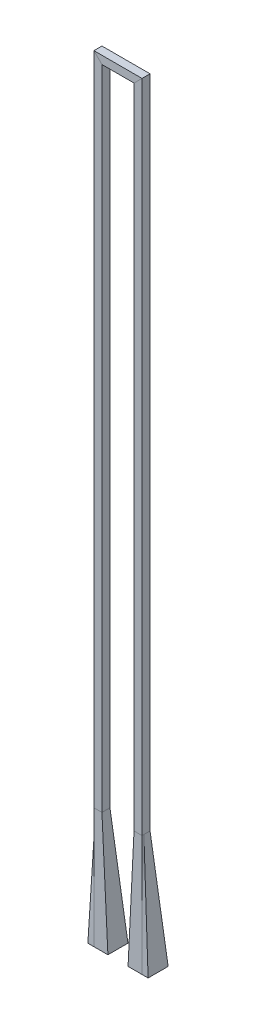
ISO-10303-21;
HEADER;
FILE_DESCRIPTION(('STEP AP214'),'2;1');
FILE_NAME('part.step','',(''),(''),'','','');
FILE_SCHEMA(('AUTOMOTIVE_DESIGN { 1 0 10303 214 1 1 1 1 }'));
ENDSEC;
DATA;
#1=APPLICATION_CONTEXT('core data for automotive mechanical design processes');
#2=APPLICATION_PROTOCOL_DEFINITION('international standard','automotive_design',2000,#1);
#3=PRODUCT_CONTEXT('',#1,'mechanical');
#4=PRODUCT('Part','Part','',(#3));
#5=PRODUCT_RELATED_PRODUCT_CATEGORY('part','',(#4));
#6=PRODUCT_DEFINITION_FORMATION('','',#4);
#7=PRODUCT_DEFINITION_CONTEXT('part definition',#1,'design');
#8=PRODUCT_DEFINITION('design','',#6,#7);
#9=PRODUCT_DEFINITION_SHAPE('','',#8);
#10=(LENGTH_UNIT() NAMED_UNIT(*) SI_UNIT(.MILLI.,.METRE.));
#11=(NAMED_UNIT(*) PLANE_ANGLE_UNIT() SI_UNIT($,.RADIAN.));
#12=(NAMED_UNIT(*) SI_UNIT($,.STERADIAN.) SOLID_ANGLE_UNIT());
#13=UNCERTAINTY_MEASURE_WITH_UNIT(LENGTH_MEASURE(1.E-05),#10,'distance_accuracy_value','');
#14=(GEOMETRIC_REPRESENTATION_CONTEXT(3) GLOBAL_UNCERTAINTY_ASSIGNED_CONTEXT((#13)) GLOBAL_UNIT_ASSIGNED_CONTEXT((#10,
#11,#12)) REPRESENTATION_CONTEXT('',''));
#15=CARTESIAN_POINT('',(0.,0.,0.));
#16=DIRECTION('',(0.,0.,1.));
#17=DIRECTION('',(1.,0.,0.));
#18=AXIS2_PLACEMENT_3D('',#15,#16,#17);
#19=CARTESIAN_POINT('',(2.794,41.6544,0.254));
#20=DIRECTION('',(-1.,0.,0.));
#21=DIRECTION('',(0.,-1.,0.));
#22=AXIS2_PLACEMENT_3D('',#19,#20,#21);
#23=PLANE('',#22);
#24=DIRECTION('',(0.,0.,1.));
#25=VECTOR('',#24,1.);
#26=CARTESIAN_POINT('',(2.79399999999999,41.529,0.254));
#27=LINE('',#26,#25);
#28=CARTESIAN_POINT('',(2.79399999999999,41.529,-0.254));
#29=VERTEX_POINT('',#28);
#30=CARTESIAN_POINT('',(2.79399999999999,41.529,0.254));
#31=VERTEX_POINT('',#30);
#32=EDGE_CURVE('E280',#29,#31,#27,.T.);
#33=ORIENTED_EDGE('',*,*,#32,.T.);
#34=DIRECTION('',(0.,-1.,0.));
#35=VECTOR('',#34,1.);
#36=CARTESIAN_POINT('',(2.794,41.6544,0.254));
#37=LINE('',#36,#35);
#38=CARTESIAN_POINT('',(2.794,0.,0.254));
#39=VERTEX_POINT('',#38);
#40=EDGE_CURVE('E851',#31,#39,#37,.T.);
#41=ORIENTED_EDGE('',*,*,#40,.T.);
#42=DIRECTION('',(0.,0.,-1.));
#43=VECTOR('',#42,1.);
#44=CARTESIAN_POINT('',(2.794,0.,0.254));
#45=LINE('',#44,#43);
#46=CARTESIAN_POINT('',(2.794,0.,0.136048087951876));
#47=VERTEX_POINT('',#46);
#48=EDGE_CURVE('E842',#39,#47,#45,.T.);
#49=ORIENTED_EDGE('',*,*,#48,.T.);
#50=DIRECTION('',(0.,0.,1.));
#51=VECTOR('',#50,1.);
#52=CARTESIAN_POINT('',(2.794,0.,-0.254));
#53=LINE('',#52,#51);
#54=CARTESIAN_POINT('',(2.794,0.,-0.254));
#55=VERTEX_POINT('',#54);
#56=EDGE_CURVE('E564',#55,#47,#53,.T.);
#57=ORIENTED_EDGE('',*,*,#56,.F.);
#58=DIRECTION('',(0.,-1.,0.));
#59=VECTOR('',#58,1.);
#60=CARTESIAN_POINT('',(2.794,41.6544,-0.254));
#61=LINE('',#60,#59);
#62=EDGE_CURVE('E840',#29,#55,#61,.T.);
#63=ORIENTED_EDGE('',*,*,#62,.F.);
#64=EDGE_LOOP('',(#33,#41,#49,#57,#63));
#65=FACE_BOUND('',#64,.T.);
#66=ADVANCED_FACE('F175',(#65),#23,.F.);
#67=CARTESIAN_POINT('',(2.794,41.6544,-0.254));
#68=DIRECTION('',(0.,0.,1.));
#69=DIRECTION('',(1.,0.,0.));
#70=AXIS2_PLACEMENT_3D('',#67,#68,#69);
#71=PLANE('',#70);
#72=DIRECTION('',(0.707106781186547,0.707106781186548,0.));
#73=VECTOR('',#72,1.);
#74=CARTESIAN_POINT('',(1.2073,39.9423,-0.254));
#75=LINE('',#74,#73);
#76=CARTESIAN_POINT('',(2.286,41.021,-0.254));
#77=VERTEX_POINT('',#76);
#78=EDGE_CURVE('E391',#77,#29,#75,.T.);
#79=ORIENTED_EDGE('',*,*,#78,.T.);
#80=ORIENTED_EDGE('',*,*,#62,.T.);
#81=DIRECTION('',(-1.,0.,0.));
#82=VECTOR('',#81,1.);
#83=CARTESIAN_POINT('',(2.794,0.,-0.254));
#84=LINE('',#83,#82);
#85=CARTESIAN_POINT('',(2.286,0.,-0.254));
#86=VERTEX_POINT('',#85);
#87=EDGE_CURVE('E829',#55,#86,#84,.T.);
#88=ORIENTED_EDGE('',*,*,#87,.T.);
#89=DIRECTION('',(0.,-1.,0.));
#90=VECTOR('',#89,1.);
#91=CARTESIAN_POINT('',(2.286,41.6544,-0.254));
#92=LINE('',#91,#90);
#93=EDGE_CURVE('E838',#77,#86,#92,.T.);
#94=ORIENTED_EDGE('',*,*,#93,.F.);
#95=EDGE_LOOP('',(#79,#80,#88,#94));
#96=FACE_BOUND('',#95,.T.);
#97=ADVANCED_FACE('F339',(#96),#71,.F.);
#98=CARTESIAN_POINT('',(2.286,41.6544,0.254));
#99=DIRECTION('',(1.,0.,0.));
#100=DIRECTION('',(0.,1.,0.));
#101=AXIS2_PLACEMENT_3D('',#98,#99,#100);
#102=PLANE('',#101);
#103=DIRECTION('',(0.,0.,-1.));
#104=VECTOR('',#103,1.);
#105=CARTESIAN_POINT('',(2.286,41.021,0.254));
#106=LINE('',#105,#104);
#107=CARTESIAN_POINT('',(2.286,41.021,0.254));
#108=VERTEX_POINT('',#107);
#109=EDGE_CURVE('E844',#108,#77,#106,.T.);
#110=ORIENTED_EDGE('',*,*,#109,.T.);
#111=ORIENTED_EDGE('',*,*,#93,.T.);
#112=DIRECTION('',(0.,0.,1.));
#113=VECTOR('',#112,1.);
#114=CARTESIAN_POINT('',(2.286,0.,0.254));
#115=LINE('',#114,#113);
#116=CARTESIAN_POINT('',(2.286,0.,0.254));
#117=VERTEX_POINT('',#116);
#118=EDGE_CURVE('E822',#86,#117,#115,.T.);
#119=ORIENTED_EDGE('',*,*,#118,.T.);
#120=DIRECTION('',(0.,-1.,0.));
#121=VECTOR('',#120,1.);
#122=CARTESIAN_POINT('',(2.286,41.6544,0.254));
#123=LINE('',#122,#121);
#124=EDGE_CURVE('E847',#108,#117,#123,.T.);
#125=ORIENTED_EDGE('',*,*,#124,.F.);
#126=EDGE_LOOP('',(#110,#111,#119,#125));
#127=FACE_BOUND('',#126,.T.);
#128=ADVANCED_FACE('F343',(#127),#102,.F.);
#129=CARTESIAN_POINT('',(2.794,41.6544,0.254));
#130=DIRECTION('',(0.,0.,-1.));
#131=DIRECTION('',(-1.,0.,0.));
#132=AXIS2_PLACEMENT_3D('',#129,#130,#131);
#133=PLANE('',#132);
#134=DIRECTION('',(-0.707106781186547,-0.707106781186548,0.));
#135=VECTOR('',#134,1.);
#136=CARTESIAN_POINT('',(1.2073,39.9423,0.254));
#137=LINE('',#136,#135);
#138=EDGE_CURVE('E276',#31,#108,#137,.T.);
#139=ORIENTED_EDGE('',*,*,#138,.T.);
#140=ORIENTED_EDGE('',*,*,#124,.T.);
#141=DIRECTION('',(1.,0.,0.));
#142=VECTOR('',#141,1.);
#143=CARTESIAN_POINT('',(2.794,0.,0.254));
#144=LINE('',#143,#142);
#145=EDGE_CURVE('E830',#117,#39,#144,.T.);
#146=ORIENTED_EDGE('',*,*,#145,.T.);
#147=ORIENTED_EDGE('',*,*,#40,.F.);
#148=EDGE_LOOP('',(#139,#140,#146,#147));
#149=FACE_BOUND('',#148,.T.);
#150=ADVANCED_FACE('F177',(#149),#133,.F.);
#151=CARTESIAN_POINT('',(-0.379399999999989,41.529,0.254));
#152=DIRECTION('',(0.,0.,-1.));
#153=DIRECTION('',(-1.,0.,0.));
#154=AXIS2_PLACEMENT_3D('',#151,#152,#153);
#155=PLANE('',#154);
#156=DIRECTION('',(1.,0.,0.));
#157=VECTOR('',#156,1.);
#158=CARTESIAN_POINT('',(-0.379399999999989,41.529,0.254));
#159=LINE('',#158,#157);
#160=CARTESIAN_POINT('',(-0.253999999999991,41.529,0.254));
#161=VERTEX_POINT('',#160);
#162=EDGE_CURVE('E272',#161,#31,#159,.T.);
#163=ORIENTED_EDGE('',*,*,#162,.F.);
#164=DIRECTION('',(0.707106781186548,-0.707106781186548,0.));
#165=VECTOR('',#164,1.);
#166=CARTESIAN_POINT('',(20.5105,20.7645,0.254));
#167=LINE('',#166,#165);
#168=CARTESIAN_POINT('',(0.254000000000006,41.021,0.254));
#169=VERTEX_POINT('',#168);
#170=EDGE_CURVE('E258',#161,#169,#167,.T.);
#171=ORIENTED_EDGE('',*,*,#170,.T.);
#172=DIRECTION('',(1.,0.,0.));
#173=VECTOR('',#172,1.);
#174=CARTESIAN_POINT('',(-0.379399999999989,41.021,0.254));
#175=LINE('',#174,#173);
#176=EDGE_CURVE('E883',#169,#108,#175,.T.);
#177=ORIENTED_EDGE('',*,*,#176,.T.);
#178=ORIENTED_EDGE('',*,*,#138,.F.);
#179=EDGE_LOOP('',(#163,#171,#177,#178));
#180=FACE_BOUND('',#179,.T.);
#181=ADVANCED_FACE('F274',(#180),#155,.F.);
#182=CARTESIAN_POINT('',(-0.379399999999989,41.021,0.254));
#183=DIRECTION('',(0.,1.,0.));
#184=DIRECTION('',(0.,0.,1.));
#185=AXIS2_PLACEMENT_3D('',#182,#183,#184);
#186=PLANE('',#185);
#187=ORIENTED_EDGE('',*,*,#176,.F.);
#188=DIRECTION('',(0.,0.,-1.));
#189=VECTOR('',#188,1.);
#190=CARTESIAN_POINT('',(0.254000000000007,41.021,0.254));
#191=LINE('',#190,#189);
#192=CARTESIAN_POINT('',(0.254000000000005,41.021,-0.254));
#193=VERTEX_POINT('',#192);
#194=EDGE_CURVE('E187',#169,#193,#191,.T.);
#195=ORIENTED_EDGE('',*,*,#194,.T.);
#196=DIRECTION('',(1.,0.,0.));
#197=VECTOR('',#196,1.);
#198=CARTESIAN_POINT('',(-0.379399999999989,41.021,-0.254));
#199=LINE('',#198,#197);
#200=EDGE_CURVE('E886',#193,#77,#199,.T.);
#201=ORIENTED_EDGE('',*,*,#200,.T.);
#202=ORIENTED_EDGE('',*,*,#109,.F.);
#203=EDGE_LOOP('',(#187,#195,#201,#202));
#204=FACE_BOUND('',#203,.T.);
#205=ADVANCED_FACE('F330',(#204),#186,.F.);
#206=CARTESIAN_POINT('',(-0.379399999999989,41.529,-0.254));
#207=DIRECTION('',(0.,0.,1.));
#208=DIRECTION('',(1.,0.,0.));
#209=AXIS2_PLACEMENT_3D('',#206,#207,#208);
#210=PLANE('',#209);
#211=ORIENTED_EDGE('',*,*,#200,.F.);
#212=DIRECTION('',(-0.707106781186548,0.707106781186548,0.));
#213=VECTOR('',#212,1.);
#214=CARTESIAN_POINT('',(20.5105,20.7645,-0.254));
#215=LINE('',#214,#213);
#216=CARTESIAN_POINT('',(-0.253999999999991,41.529,-0.254));
#217=VERTEX_POINT('',#216);
#218=EDGE_CURVE('E13',#193,#217,#215,.T.);
#219=ORIENTED_EDGE('',*,*,#218,.T.);
#220=DIRECTION('',(1.,0.,0.));
#221=VECTOR('',#220,1.);
#222=CARTESIAN_POINT('',(-0.379399999999989,41.529,-0.254));
#223=LINE('',#222,#221);
#224=EDGE_CURVE('E281',#217,#29,#223,.T.);
#225=ORIENTED_EDGE('',*,*,#224,.T.);
#226=ORIENTED_EDGE('',*,*,#78,.F.);
#227=EDGE_LOOP('',(#211,#219,#225,#226));
#228=FACE_BOUND('',#227,.T.);
#229=ADVANCED_FACE('F327',(#228),#210,.F.);
#230=CARTESIAN_POINT('',(-0.379399999999989,41.529,0.254));
#231=DIRECTION('',(0.,-1.,0.));
#232=DIRECTION('',(0.,0.,-1.));
#233=AXIS2_PLACEMENT_3D('',#230,#231,#232);
#234=PLANE('',#233);
#235=ORIENTED_EDGE('',*,*,#224,.F.);
#236=DIRECTION('',(0.,0.,1.));
#237=VECTOR('',#236,1.);
#238=CARTESIAN_POINT('',(-0.253999999999993,41.529,0.254));
#239=LINE('',#238,#237);
#240=EDGE_CURVE('E269',#217,#161,#239,.T.);
#241=ORIENTED_EDGE('',*,*,#240,.T.);
#242=ORIENTED_EDGE('',*,*,#162,.T.);
#243=ORIENTED_EDGE('',*,*,#32,.F.);
#244=EDGE_LOOP('',(#235,#241,#242,#243));
#245=FACE_BOUND('',#244,.T.);
#246=ADVANCED_FACE('F284',(#245),#234,.F.);
#247=CARTESIAN_POINT('',(-0.253999999999993,0.,0.254));
#248=DIRECTION('',(0.,0.,-1.));
#249=DIRECTION('',(-1.,0.,0.));
#250=AXIS2_PLACEMENT_3D('',#247,#248,#249);
#251=PLANE('',#250);
#252=DIRECTION('',(0.,1.,0.));
#253=VECTOR('',#252,1.);
#254=CARTESIAN_POINT('',(-0.253999999999993,0.,0.254));
#255=LINE('',#254,#253);
#256=CARTESIAN_POINT('',(-0.253999999999993,0.,0.254));
#257=VERTEX_POINT('',#256);
#258=EDGE_CURVE('E262',#257,#161,#255,.T.);
#259=ORIENTED_EDGE('',*,*,#258,.F.);
#260=DIRECTION('',(-1.,0.,0.));
#261=VECTOR('',#260,1.);
#262=CARTESIAN_POINT('',(-0.253999999999993,0.,0.254));
#263=LINE('',#262,#261);
#264=CARTESIAN_POINT('',(0.254000000000007,0.,0.254));
#265=VERTEX_POINT('',#264);
#266=EDGE_CURVE('E293',#265,#257,#263,.T.);
#267=ORIENTED_EDGE('',*,*,#266,.F.);
#268=DIRECTION('',(0.,1.,0.));
#269=VECTOR('',#268,1.);
#270=CARTESIAN_POINT('',(0.254000000000007,0.,0.254));
#271=LINE('',#270,#269);
#272=EDGE_CURVE('E265',#265,#169,#271,.T.);
#273=ORIENTED_EDGE('',*,*,#272,.T.);
#274=ORIENTED_EDGE('',*,*,#170,.F.);
#275=EDGE_LOOP('',(#259,#267,#273,#274));
#276=FACE_BOUND('',#275,.T.);
#277=ADVANCED_FACE('F260',(#276),#251,.F.);
#278=CARTESIAN_POINT('',(0.254000000000007,0.,0.254));
#279=DIRECTION('',(-1.,0.,0.));
#280=DIRECTION('',(0.,0.,1.));
#281=AXIS2_PLACEMENT_3D('',#278,#279,#280);
#282=PLANE('',#281);
#283=ORIENTED_EDGE('',*,*,#272,.F.);
#284=DIRECTION('',(0.,0.,1.));
#285=VECTOR('',#284,1.);
#286=CARTESIAN_POINT('',(0.254000000000007,0.,0.254));
#287=LINE('',#286,#285);
#288=CARTESIAN_POINT('',(0.254,0.,-0.254));
#289=VERTEX_POINT('',#288);
#290=EDGE_CURVE('E300',#289,#265,#287,.T.);
#291=ORIENTED_EDGE('',*,*,#290,.F.);
#292=DIRECTION('',(0.,1.,0.));
#293=VECTOR('',#292,1.);
#294=CARTESIAN_POINT('',(0.254000000000007,0.,-0.254));
#295=LINE('',#294,#293);
#296=EDGE_CURVE('E297',#289,#193,#295,.T.);
#297=ORIENTED_EDGE('',*,*,#296,.T.);
#298=ORIENTED_EDGE('',*,*,#194,.F.);
#299=EDGE_LOOP('',(#283,#291,#297,#298));
#300=FACE_BOUND('',#299,.T.);
#301=ADVANCED_FACE('F322',(#300),#282,.F.);
#302=CARTESIAN_POINT('',(-0.253999999999993,0.,-0.254));
#303=DIRECTION('',(0.,0.,1.));
#304=DIRECTION('',(1.,0.,0.));
#305=AXIS2_PLACEMENT_3D('',#302,#303,#304);
#306=PLANE('',#305);
#307=ORIENTED_EDGE('',*,*,#296,.F.);
#308=DIRECTION('',(1.,0.,0.));
#309=VECTOR('',#308,1.);
#310=CARTESIAN_POINT('',(-0.253999999999993,0.,-0.254));
#311=LINE('',#310,#309);
#312=CARTESIAN_POINT('',(-0.253999999999993,0.,-0.254));
#313=VERTEX_POINT('',#312);
#314=EDGE_CURVE('E390',#313,#289,#311,.T.);
#315=ORIENTED_EDGE('',*,*,#314,.F.);
#316=DIRECTION('',(0.,1.,0.));
#317=VECTOR('',#316,1.);
#318=CARTESIAN_POINT('',(-0.253999999999993,0.,-0.254));
#319=LINE('',#318,#317);
#320=EDGE_CURVE('E292',#313,#217,#319,.T.);
#321=ORIENTED_EDGE('',*,*,#320,.T.);
#322=ORIENTED_EDGE('',*,*,#218,.F.);
#323=EDGE_LOOP('',(#307,#315,#321,#322));
#324=FACE_BOUND('',#323,.T.);
#325=ADVANCED_FACE('F353',(#324),#306,.F.);
#326=CARTESIAN_POINT('',(-0.253999999999993,0.,0.254));
#327=DIRECTION('',(1.,0.,0.));
#328=DIRECTION('',(0.,0.,-1.));
#329=AXIS2_PLACEMENT_3D('',#326,#327,#328);
#330=PLANE('',#329);
#331=ORIENTED_EDGE('',*,*,#320,.F.);
#332=DIRECTION('',(0.,0.,-1.));
#333=VECTOR('',#332,1.);
#334=CARTESIAN_POINT('',(-0.253999999999993,0.,0.254));
#335=LINE('',#334,#333);
#336=CARTESIAN_POINT('',(-0.253999999999993,0.,0.136048087951876));
#337=VERTEX_POINT('',#336);
#338=EDGE_CURVE('E195',#337,#313,#335,.T.);
#339=ORIENTED_EDGE('',*,*,#338,.F.);
#340=EDGE_CURVE('E290',#257,#337,#335,.T.);
#341=ORIENTED_EDGE('',*,*,#340,.F.);
#342=ORIENTED_EDGE('',*,*,#258,.T.);
#343=ORIENTED_EDGE('',*,*,#240,.F.);
#344=EDGE_LOOP('',(#331,#339,#341,#342,#343));
#345=FACE_BOUND('',#344,.T.);
#346=ADVANCED_FACE('F288',(#345),#330,.F.);
#347=CARTESIAN_POINT('',(0.,-7.62,0.));
#348=DIRECTION('',(0.,-1.,0.));
#349=DIRECTION('',(0.,0.,-1.));
#350=AXIS2_PLACEMENT_3D('',#347,#348,#349);
#351=PLANE('',#350);
#352=DIRECTION('',(0.,0.,-1.));
#353=VECTOR('',#352,1.);
#354=CARTESIAN_POINT('',(1.90805246155084,-7.62,-1.0174066249893));
#355=LINE('',#354,#353);
#356=CARTESIAN_POINT('',(1.90805246155084,-7.62,0.254));
#357=VERTEX_POINT('',#356);
#358=CARTESIAN_POINT('',(1.90805246155084,-7.62,-1.016));
#359=VERTEX_POINT('',#358);
#360=EDGE_CURVE('E380',#357,#359,#355,.T.);
#361=ORIENTED_EDGE('',*,*,#360,.T.);
#362=DIRECTION('',(1.,0.,0.));
#363=VECTOR('',#362,1.);
#364=CARTESIAN_POINT('',(3.17805246155084,-7.62,-1.0174066249893));
#365=LINE('',#364,#363);
#366=CARTESIAN_POINT('',(3.17805246155084,-7.62,-1.016));
#367=VERTEX_POINT('',#366);
#368=EDGE_CURVE('E576',#359,#367,#365,.T.);
#369=ORIENTED_EDGE('',*,*,#368,.T.);
#370=DIRECTION('',(0.,0.,1.));
#371=VECTOR('',#370,1.);
#372=CARTESIAN_POINT('',(3.17805246155084,-7.62,-1.0174066249893));
#373=LINE('',#372,#371);
#374=CARTESIAN_POINT('',(3.17805246155084,-7.62,0.254));
#375=VERTEX_POINT('',#374);
#376=EDGE_CURVE('E600',#367,#375,#373,.T.);
#377=ORIENTED_EDGE('',*,*,#376,.T.);
#378=DIRECTION('',(-1.,0.,0.));
#379=VECTOR('',#378,1.);
#380=CARTESIAN_POINT('',(3.17805246155084,-7.62,0.2525933750107));
#381=LINE('',#380,#379);
#382=CARTESIAN_POINT('',(2.794,-7.62,0.254));
#383=VERTEX_POINT('',#382);
#384=EDGE_CURVE('E505',#375,#383,#381,.T.);
#385=ORIENTED_EDGE('',*,*,#384,.T.);
#386=EDGE_CURVE('E497',#383,#357,#381,.T.);
#387=ORIENTED_EDGE('',*,*,#386,.T.);
#388=EDGE_LOOP('',(#361,#369,#377,#385,#387));
#389=FACE_BOUND('',#388,.T.);
#390=ADVANCED_FACE('F341',(#389),#351,.T.);
#391=CARTESIAN_POINT('',(1.90805246155084,-7.62,0.254));
#392=CARTESIAN_POINT('',(2.03403497436723,-5.08,0.253062250007134));
#393=CARTESIAN_POINT('',(2.16001748718361,-2.54,0.253531125003567));
#394=CARTESIAN_POINT('',(2.286,0.,0.254));
#395=CARTESIAN_POINT('',(1.98188142308827,-7.62,0.254));
#396=CARTESIAN_POINT('',(2.09736539316996,-5.08,0.253062250007134));
#397=CARTESIAN_POINT('',(2.21284936325165,-2.54,0.253531125003567));
#398=CARTESIAN_POINT('',(2.32833333333333,0.,0.254));
#399=CARTESIAN_POINT('',(2.12953934616313,-7.62,0.254));
#400=CARTESIAN_POINT('',(2.22402623077542,-5.08,0.253062250007133));
#401=CARTESIAN_POINT('',(2.31851311538771,-2.54,0.253531125003566));
#402=CARTESIAN_POINT('',(2.413,0.,0.254));
#403=CARTESIAN_POINT('',(2.35102623077542,-7.62,0.254));
#404=CARTESIAN_POINT('',(2.41401748718362,-5.08,0.253062250007134));
#405=CARTESIAN_POINT('',(2.47700874359181,-2.54,0.253531125003567));
#406=CARTESIAN_POINT('',(2.54,0.,0.254));
#407=CARTESIAN_POINT('',(2.57251311538771,-7.62,0.254));
#408=CARTESIAN_POINT('',(2.60400874359181,-5.08,0.253062250007133));
#409=CARTESIAN_POINT('',(2.6355043717959,-2.54,0.253531125003566));
#410=CARTESIAN_POINT('',(2.667,0.,0.253999999999999));
#411=CARTESIAN_POINT('',(2.72017103846257,-7.62,0.254));
#412=CARTESIAN_POINT('',(2.73066958119727,-5.08,0.253062250007134));
#413=CARTESIAN_POINT('',(2.74116812393197,-2.54,0.253531125003567));
#414=CARTESIAN_POINT('',(2.75166666666667,0.,0.254));
#415=CARTESIAN_POINT('',(2.794,-7.62,0.254));
#416=CARTESIAN_POINT('',(2.794,-5.08,0.253062250007134));
#417=CARTESIAN_POINT('',(2.794,-2.54,0.253531125003567));
#418=CARTESIAN_POINT('',(2.794,0.,0.254));
#419=B_SPLINE_SURFACE_WITH_KNOTS('',3,3,((#391,#392,#393,#394),(#395,#396,#397,#398),(#399,#400,
#401,#402),(#403,#404,#405,#406),(#407,#408,#409,#410),(#411,#412,#413,#414),(#415,#416,#417,
#418)),.UNSPECIFIED.,.F.,.F.,.F.,(4,1,1,1,4),(4,4),(0.78780043912902,0.840850329346765,
0.89390021956451,0.946950109782255,1.),(0.,1.),.UNSPECIFIED.);
#420=CARTESIAN_POINT('',(2.794,-7.62,0.254));
#421=CARTESIAN_POINT('',(2.794,-5.08,0.253062250007134));
#422=CARTESIAN_POINT('',(2.794,-2.54,0.253531125003567));
#423=CARTESIAN_POINT('',(2.794,0.,0.254));
#424=B_SPLINE_CURVE_WITH_KNOTS('',3,(#420,#421,#422,#423),.UNSPECIFIED.,.F.,.F.,(4,4),(0.,1.),.UNSPECIFIED.);
#425=EDGE_CURVE('E229',#383,#39,#424,.T.);
#426=CARTESIAN_POINT('',(1.90805246155084,-7.62,0.254));
#427=CARTESIAN_POINT('',(2.03403497436723,-5.08,0.253062250007134));
#428=CARTESIAN_POINT('',(2.16001748718361,-2.54,0.253531125003567));
#429=CARTESIAN_POINT('',(2.286,0.,0.254));
#430=B_SPLINE_CURVE_WITH_KNOTS('',3,(#426,#427,#428,#429),.UNSPECIFIED.,.F.,.F.,(4,4),(0.,1.),.UNSPECIFIED.);
#431=EDGE_CURVE('E565',#357,#117,#430,.T.);
#432=ORIENTED_EDGE('',*,*,#386,.F.);
#433=ORIENTED_EDGE('',*,*,#425,.T.);
#434=ORIENTED_EDGE('',*,*,#145,.F.);
#435=ORIENTED_EDGE('',*,*,#431,.F.);
#436=EDGE_LOOP('',(#432,#433,#434,#435));
#437=FACE_BOUND('',#436,.T.);
#438=ADVANCED_FACE('F360',(#437),#419,.T.);
#439=CARTESIAN_POINT('',(1.90805246155084,-7.62,-1.016));
#440=DIRECTION('',(-0.998772213936185,0.04953851702475,0.));
#441=DIRECTION('',(0.,0.,1.));
#442=AXIS2_PLACEMENT_3D('',#439,#440,#441);
#443=PLANE('',#442);
#444=ORIENTED_EDGE('',*,*,#360,.F.);
#445=ORIENTED_EDGE('',*,*,#431,.T.);
#446=ORIENTED_EDGE('',*,*,#118,.F.);
#447=CARTESIAN_POINT('',(1.90805246155084,-7.62,-1.016));
#448=CARTESIAN_POINT('',(2.03403497436723,-5.08,-0.762937749992867));
#449=CARTESIAN_POINT('',(2.16001748718361,-2.54,-0.508468874996433));
#450=CARTESIAN_POINT('',(2.286,0.,-0.254));
#451=B_SPLINE_CURVE_WITH_KNOTS('',3,(#447,#448,#449,#450),.UNSPECIFIED.,.F.,.F.,(4,4),(0.,1.),.UNSPECIFIED.);
#452=EDGE_CURVE('E824',#359,#86,#451,.T.);
#453=ORIENTED_EDGE('',*,*,#452,.F.);
#454=EDGE_LOOP('',(#444,#445,#446,#453));
#455=FACE_BOUND('',#454,.T.);
#456=ADVANCED_FACE('F529',(#455),#443,.T.);
#457=CARTESIAN_POINT('',(3.17805246155084,-7.62,-1.016));
#458=CARTESIAN_POINT('',(3.05003497436723,-5.08,-0.762937749992867));
#459=CARTESIAN_POINT('',(2.92201748718362,-2.54,-0.508468874996433));
#460=CARTESIAN_POINT('',(2.794,0.,-0.254));
#461=CARTESIAN_POINT('',(3.07221912821751,-7.62,-1.016));
#462=CARTESIAN_POINT('',(2.96536830770056,-5.08,-0.762937749992867));
#463=CARTESIAN_POINT('',(2.85851748718361,-2.54,-0.508468874996433));
#464=CARTESIAN_POINT('',(2.75166666666667,0.,-0.254));
#465=CARTESIAN_POINT('',(2.86055246155084,-7.62000000000001,-1.016));
#466=CARTESIAN_POINT('',(2.79603497436723,-5.08000000000001,-0.762937749992868));
#467=CARTESIAN_POINT('',(2.73151748718361,-2.54,-0.508468874996434));
#468=CARTESIAN_POINT('',(2.667,0.,-0.254));
#469=CARTESIAN_POINT('',(2.54305246155085,-7.61999999999999,-1.016));
#470=CARTESIAN_POINT('',(2.54203497436723,-5.07999999999999,-0.762937749992866));
#471=CARTESIAN_POINT('',(2.54101748718361,-2.54,-0.508468874996433));
#472=CARTESIAN_POINT('',(2.54,0.,-0.254));
#473=CARTESIAN_POINT('',(2.22555246155084,-7.62000000000001,-1.016));
#474=CARTESIAN_POINT('',(2.28803497436723,-5.08,-0.762937749992867));
#475=CARTESIAN_POINT('',(2.35051748718361,-2.54,-0.508468874996434));
#476=CARTESIAN_POINT('',(2.413,0.,-0.254));
#477=CARTESIAN_POINT('',(2.01388579488418,-7.62,-1.016));
#478=CARTESIAN_POINT('',(2.1187016410339,-5.08,-0.762937749992867));
#479=CARTESIAN_POINT('',(2.22351748718361,-2.54,-0.508468874996433));
#480=CARTESIAN_POINT('',(2.32833333333333,0.,-0.254));
#481=CARTESIAN_POINT('',(1.90805246155084,-7.62,-1.016));
#482=CARTESIAN_POINT('',(2.03403497436723,-5.08,-0.762937749992867));
#483=CARTESIAN_POINT('',(2.16001748718361,-2.54,-0.508468874996433));
#484=CARTESIAN_POINT('',(2.286,0.,-0.254));
#485=B_SPLINE_SURFACE_WITH_KNOTS('',3,3,((#457,#458,#459,#460),(#461,#462,#463,#464),(#465,#466,
#467,#468),(#469,#470,#471,#472),(#473,#474,#475,#476),(#477,#478,#479,#480),(#481,#482,#483,
#484)),.UNSPECIFIED.,.F.,.F.,.F.,(4,1,1,1,4),(4,4),(0.28780043912902,0.35030043912902,
0.41280043912902,0.47530043912902,0.53780043912902),(0.,1.),.UNSPECIFIED.);
#486=CARTESIAN_POINT('',(3.17805246155084,-7.62,-1.016));
#487=CARTESIAN_POINT('',(3.05003497436723,-5.08,-0.762937749992867));
#488=CARTESIAN_POINT('',(2.92201748718362,-2.54,-0.508468874996433));
#489=CARTESIAN_POINT('',(2.794,0.,-0.254));
#490=B_SPLINE_CURVE_WITH_KNOTS('',3,(#486,#487,#488,#489),.UNSPECIFIED.,.F.,.F.,(4,4),(0.,1.),.UNSPECIFIED.);
#491=EDGE_CURVE('E575',#367,#55,#490,.T.);
#492=ORIENTED_EDGE('',*,*,#368,.F.);
#493=ORIENTED_EDGE('',*,*,#452,.T.);
#494=ORIENTED_EDGE('',*,*,#87,.F.);
#495=ORIENTED_EDGE('',*,*,#491,.F.);
#496=EDGE_LOOP('',(#492,#493,#494,#495));
#497=FACE_BOUND('',#496,.T.);
#498=ADVANCED_FACE('F538',(#497),#485,.T.);
#499=CARTESIAN_POINT('',(3.17805246155084,-7.62,0.254));
#500=DIRECTION('',(0.998732305146685,0.0503366929425109,0.));
#501=DIRECTION('',(0.,0.,-1.));
#502=AXIS2_PLACEMENT_3D('',#499,#500,#501);
#503=PLANE('',#502);
#504=ORIENTED_EDGE('',*,*,#376,.F.);
#505=ORIENTED_EDGE('',*,*,#491,.T.);
#506=ORIENTED_EDGE('',*,*,#56,.T.);
#507=CARTESIAN_POINT('',(3.17805246155084,-7.62,0.254));
#508=CARTESIAN_POINT('',(3.05003497436723,-5.08,0.213744945991092));
#509=CARTESIAN_POINT('',(2.92201748718362,-2.54,0.174896516971484));
#510=CARTESIAN_POINT('',(2.794,0.,0.136048087951876));
#511=B_SPLINE_CURVE_WITH_KNOTS('',3,(#507,#508,#509,#510),.UNSPECIFIED.,.F.,.F.,(4,4),(0.,1.),.UNSPECIFIED.);
#512=EDGE_CURVE('E237',#375,#47,#511,.T.);
#513=ORIENTED_EDGE('',*,*,#512,.F.);
#514=EDGE_LOOP('',(#504,#505,#506,#513));
#515=FACE_BOUND('',#514,.T.);
#516=ADVANCED_FACE('F365',(#515),#503,.T.);
#517=CARTESIAN_POINT('',(2.794,-7.62,0.254));
#518=CARTESIAN_POINT('',(2.794,-5.08,0.253062250007134));
#519=CARTESIAN_POINT('',(2.794,-2.54,0.253531125003567));
#520=CARTESIAN_POINT('',(2.794,0.,0.254));
#521=CARTESIAN_POINT('',(2.8260043717959,-7.62,0.254));
#522=CARTESIAN_POINT('',(2.81533624786394,-5.08,0.249785808005797));
#523=CARTESIAN_POINT('',(2.80466812393197,-2.54,0.246978241000893));
#524=CARTESIAN_POINT('',(2.794,0.,0.244170673995989));
#525=CARTESIAN_POINT('',(2.89001311538771,-7.62,0.254));
#526=CARTESIAN_POINT('',(2.85800874359181,-5.08,0.243232924003123));
#527=CARTESIAN_POINT('',(2.8260043717959,-2.54,0.233872472995546));
#528=CARTESIAN_POINT('',(2.794,0.,0.224512021987969));
#529=CARTESIAN_POINT('',(2.98602623077542,-7.62,0.254));
#530=CARTESIAN_POINT('',(2.92201748718361,-5.08,0.233403597999113));
#531=CARTESIAN_POINT('',(2.85800874359181,-2.54,0.214213820987525));
#532=CARTESIAN_POINT('',(2.794,0.,0.195024043975938));
#533=CARTESIAN_POINT('',(3.08203934616313,-7.62,0.254));
#534=CARTESIAN_POINT('',(2.98602623077542,-5.08,0.223574271995102));
#535=CARTESIAN_POINT('',(2.89001311538771,-2.54,0.194555168979504));
#536=CARTESIAN_POINT('',(2.794,0.,0.165536065963907));
#537=CARTESIAN_POINT('',(3.14604808975494,-7.62,0.254));
#538=CARTESIAN_POINT('',(3.02869872650329,-5.08,0.217021387992429));
#539=CARTESIAN_POINT('',(2.91134936325165,-2.54,0.181449400974157));
#540=CARTESIAN_POINT('',(2.794,0.,0.145877413955886));
#541=CARTESIAN_POINT('',(3.17805246155084,-7.62,0.254));
#542=CARTESIAN_POINT('',(3.05003497436723,-5.08,0.213744945991092));
#543=CARTESIAN_POINT('',(2.92201748718362,-2.54,0.174896516971484));
#544=CARTESIAN_POINT('',(2.794,0.,0.136048087951876));
#545=B_SPLINE_SURFACE_WITH_KNOTS('',3,3,((#517,#518,#519,#520),(#521,#522,#523,#524),(#525,#526,
#527,#528),(#529,#530,#531,#532),(#533,#534,#535,#536),(#537,#538,#539,#540),(#541,#542,#543,
#544)),.UNSPECIFIED.,.F.,.F.,.F.,(4,1,1,1,4),(4,4),(0.,0.0167060098836406,0.0334120197672812,
0.0501180296509218,0.0668240395345624),(0.,1.),.UNSPECIFIED.);
#546=ORIENTED_EDGE('',*,*,#384,.F.);
#547=ORIENTED_EDGE('',*,*,#512,.T.);
#548=ORIENTED_EDGE('',*,*,#48,.F.);
#549=ORIENTED_EDGE('',*,*,#425,.F.);
#550=EDGE_LOOP('',(#546,#547,#548,#549));
#551=FACE_BOUND('',#550,.T.);
#552=ADVANCED_FACE('F466',(#551),#545,.T.);
#553=CARTESIAN_POINT('',(2.54,-7.62,0.));
#554=DIRECTION('',(0.,-1.,0.));
#555=DIRECTION('',(0.,0.,-1.));
#556=AXIS2_PLACEMENT_3D('',#553,#554,#555);
#557=PLANE('',#556);
#558=CARTESIAN_POINT('',(0.631947538449156,-7.62,0.2525933750107));
#559=DIRECTION('',(0.,0.,-1.));
#560=VECTOR('',#559,1.);
#561=LINE('',#558,#560);
#562=CARTESIAN_POINT('',(0.631947538449156,-7.62,0.254));
#563=VERTEX_POINT('',#562);
#564=CARTESIAN_POINT('',(0.631947538449156,-7.62,-1.016));
#565=VERTEX_POINT('',#564);
#566=EDGE_CURVE('E634',#563,#565,#561,.T.);
#567=ORIENTED_EDGE('',*,*,#566,.F.);
#568=CARTESIAN_POINT('',(-0.254,-7.62,0.254));
#569=CARTESIAN_POINT('',(-0.180171038462571,-7.62,0.254));
#570=CARTESIAN_POINT('',(-0.0325131153877099,-7.62,0.254));
#571=CARTESIAN_POINT('',(0.188973769224578,-7.62,0.254));
#572=CARTESIAN_POINT('',(0.410460653836866,-7.62,0.254));
#573=CARTESIAN_POINT('',(0.558118576911726,-7.62,0.254));
#574=CARTESIAN_POINT('',(0.631947538449156,-7.62,0.254));
#575=B_SPLINE_CURVE_WITH_KNOTS('',3,(#568,#569,#570,#571,#572,#573,#574),.UNSPECIFIED.,.F.,.F.,
(4,1,1,1,4),(0.78780043912902,0.840850329346765,0.89390021956451,0.946950109782255,1.),.UNSPECIFIED.);
#576=CARTESIAN_POINT('',(-0.254,-7.62,0.254));
#577=VERTEX_POINT('',#576);
#578=EDGE_CURVE('E631',#577,#563,#575,.T.);
#579=ORIENTED_EDGE('',*,*,#578,.F.);
#580=CARTESIAN_POINT('',(-0.638052461550844,-7.62,0.254));
#581=CARTESIAN_POINT('',(-0.606048089754939,-7.62,0.254));
#582=CARTESIAN_POINT('',(-0.542039346163133,-7.62,0.254));
#583=CARTESIAN_POINT('',(-0.446026230775423,-7.62,0.254));
#584=CARTESIAN_POINT('',(-0.350013115387711,-7.62,0.254));
#585=CARTESIAN_POINT('',(-0.286004371795903,-7.62,0.254));
#586=CARTESIAN_POINT('',(-0.254,-7.62,0.254));
#587=B_SPLINE_CURVE_WITH_KNOTS('',3,(#580,#581,#582,#583,#584,#585,#586),.UNSPECIFIED.,.F.,.F.,
(4,1,1,1,4),(0.,0.0167060098836406,0.0334120197672812,0.0501180296509218,0.0668240395345624),.UNSPECIFIED.);
#588=CARTESIAN_POINT('',(-0.638052461550844,-7.62,0.254));
#589=VERTEX_POINT('',#588);
#590=EDGE_CURVE('E628',#589,#577,#587,.T.);
#591=ORIENTED_EDGE('',*,*,#590,.F.);
#592=CARTESIAN_POINT('',(-0.638052461550844,-7.62,-1.016));
#593=DIRECTION('',(0.,0.,1.));
#594=VECTOR('',#593,1.);
#595=LINE('',#592,#594);
#596=CARTESIAN_POINT('',(-0.638052461550844,-7.62,-1.016));
#597=VERTEX_POINT('',#596);
#598=EDGE_CURVE('E626',#597,#589,#595,.T.);
#599=ORIENTED_EDGE('',*,*,#598,.F.);
#600=CARTESIAN_POINT('',(0.631947538449156,-7.62,-1.016));
#601=CARTESIAN_POINT('',(0.526114205115823,-7.62,-1.016));
#602=CARTESIAN_POINT('',(0.314447538449159,-7.62000000000001,-1.016));
#603=CARTESIAN_POINT('',(-0.00305246155084867,-7.61999999999999,-1.016));
#604=CARTESIAN_POINT('',(-0.320552461550842,-7.62000000000001,-1.016));
#605=CARTESIAN_POINT('',(-0.532219128217511,-7.62,-1.016));
#606=CARTESIAN_POINT('',(-0.638052461550844,-7.62,-1.016));
#607=B_SPLINE_CURVE_WITH_KNOTS('',3,(#600,#601,#602,#603,#604,#605,#606),.UNSPECIFIED.,.F.,.F.,
(4,1,1,1,4),(0.28780043912902,0.35030043912902,0.41280043912902,0.47530043912902,
0.53780043912902),.UNSPECIFIED.);
#608=EDGE_CURVE('E428',#565,#597,#607,.T.);
#609=ORIENTED_EDGE('',*,*,#608,.F.);
#610=EDGE_LOOP('',(#567,#579,#591,#599,#609));
#611=FACE_BOUND('',#610,.T.);
#612=ADVANCED_FACE('F674',(#611),#557,.T.);
#613=CARTESIAN_POINT('',(0.631947538449156,-7.62,0.254));
#614=CARTESIAN_POINT('',(0.505965025632771,-5.08,0.253062250007134));
#615=CARTESIAN_POINT('',(0.379982512816385,-2.54,0.253531125003567));
#616=CARTESIAN_POINT('',(0.254,0.,0.254));
#617=CARTESIAN_POINT('',(0.558118576911726,-7.62,0.254));
#618=CARTESIAN_POINT('',(0.44263460683004,-5.08,0.253062250007134));
#619=CARTESIAN_POINT('',(0.327150636748353,-2.54,0.253531125003567));
#620=CARTESIAN_POINT('',(0.211666666666666,0.,0.254));
#621=CARTESIAN_POINT('',(0.410460653836866,-7.62,0.254));
#622=CARTESIAN_POINT('',(0.315973769224578,-5.08,0.253062250007133));
#623=CARTESIAN_POINT('',(0.22148688461229,-2.54,0.253531125003566));
#624=CARTESIAN_POINT('',(0.127000000000001,0.,0.254));
#625=CARTESIAN_POINT('',(0.188973769224578,-7.62,0.254));
#626=CARTESIAN_POINT('',(0.125982512816385,-5.08,0.253062250007134));
#627=CARTESIAN_POINT('',(0.0629912564081925,-2.54,0.253531125003567));
#628=CARTESIAN_POINT('',(0.,0.,0.254));
#629=CARTESIAN_POINT('',(-0.0325131153877099,-7.62,0.254));
#630=CARTESIAN_POINT('',(-0.0640087435918061,-5.08,0.253062250007133));
#631=CARTESIAN_POINT('',(-0.0955043717959033,-2.54,0.253531125003566));
#632=CARTESIAN_POINT('',(-0.127,0.,0.253999999999999));
#633=CARTESIAN_POINT('',(-0.180171038462571,-7.62,0.254));
#634=CARTESIAN_POINT('',(-0.190669581197269,-5.08,0.253062250007134));
#635=CARTESIAN_POINT('',(-0.201168123931968,-2.54,0.253531125003567));
#636=CARTESIAN_POINT('',(-0.211666666666666,0.,0.254));
#637=CARTESIAN_POINT('',(-0.254,-7.62,0.254));
#638=CARTESIAN_POINT('',(-0.254,-5.08,0.253062250007134));
#639=CARTESIAN_POINT('',(-0.254,-2.54,0.253531125003567));
#640=CARTESIAN_POINT('',(-0.254,0.,0.254));
#641=B_SPLINE_SURFACE_WITH_KNOTS('',3,3,((#613,#614,#615,#616),(#617,#618,#619,#620),(#621,#622,
#623,#624),(#625,#626,#627,#628),(#629,#630,#631,#632),(#633,#634,#635,#636),(#637,#638,#639,
#640)),.UNSPECIFIED.,.F.,.F.,.F.,(4,1,1,1,4),(4,4),(0.78780043912902,0.840850329346765,
0.89390021956451,0.946950109782255,1.),(0.,1.),.UNSPECIFIED.);
#642=CARTESIAN_POINT('',(0.631947538449156,-7.62,0.254));
#643=CARTESIAN_POINT('',(0.505965025632771,-5.08,0.253062250007134));
#644=CARTESIAN_POINT('',(0.379982512816385,-2.54,0.253531125003567));
#645=CARTESIAN_POINT('',(0.254,0.,0.254));
#646=B_SPLINE_CURVE_WITH_KNOTS('',3,(#642,#643,#644,#645),.UNSPECIFIED.,.F.,.F.,(4,4),(0.,1.),.UNSPECIFIED.);
#647=EDGE_CURVE('E615',#563,#265,#646,.T.);
#648=CARTESIAN_POINT('',(-0.254,-7.62,0.254));
#649=CARTESIAN_POINT('',(-0.253999999999999,-5.08,0.253062250007134));
#650=CARTESIAN_POINT('',(-0.253999999999999,-2.54,0.253531125003567));
#651=CARTESIAN_POINT('',(-0.253999999999999,0.,0.254));
#652=B_SPLINE_CURVE_WITH_KNOTS('',3,(#648,#649,#650,#651),.UNSPECIFIED.,.F.,.F.,(4,4),(0.,1.),.UNSPECIFIED.);
#653=EDGE_CURVE('E381',#577,#257,#652,.T.);
#654=ORIENTED_EDGE('',*,*,#578,.T.);
#655=ORIENTED_EDGE('',*,*,#647,.T.);
#656=ORIENTED_EDGE('',*,*,#266,.T.);
#657=ORIENTED_EDGE('',*,*,#653,.F.);
#658=EDGE_LOOP('',(#654,#655,#656,#657));
#659=FACE_BOUND('',#658,.T.);
#660=ADVANCED_FACE('F693',(#659),#641,.F.);
#661=CARTESIAN_POINT('',(0.631947538449156,-7.62,-1.016));
#662=DIRECTION('',(0.998772213936185,0.04953851702475,0.));
#663=DIRECTION('',(0.,0.,1.));
#664=AXIS2_PLACEMENT_3D('',#661,#662,#663);
#665=PLANE('',#664);
#666=ORIENTED_EDGE('',*,*,#566,.T.);
#667=CARTESIAN_POINT('',(0.631947538449156,-7.62,-1.016));
#668=CARTESIAN_POINT('',(0.505965025632771,-5.08,-0.762937749992867));
#669=CARTESIAN_POINT('',(0.379982512816385,-2.54,-0.508468874996433));
#670=CARTESIAN_POINT('',(0.254,0.,-0.254));
#671=B_SPLINE_CURVE_WITH_KNOTS('',3,(#667,#668,#669,#670),.UNSPECIFIED.,.F.,.F.,(4,4),(0.,1.),.UNSPECIFIED.);
#672=EDGE_CURVE('E434',#565,#289,#671,.T.);
#673=ORIENTED_EDGE('',*,*,#672,.T.);
#674=ORIENTED_EDGE('',*,*,#290,.T.);
#675=ORIENTED_EDGE('',*,*,#647,.F.);
#676=EDGE_LOOP('',(#666,#673,#674,#675));
#677=FACE_BOUND('',#676,.T.);
#678=ADVANCED_FACE('F460',(#677),#665,.T.);
#679=CARTESIAN_POINT('',(-0.638052461550844,-7.62,-1.016));
#680=CARTESIAN_POINT('',(-0.510034974367229,-5.08,-0.762937749992867));
#681=CARTESIAN_POINT('',(-0.382017487183615,-2.54,-0.508468874996433));
#682=CARTESIAN_POINT('',(-0.254,0.,-0.254));
#683=CARTESIAN_POINT('',(-0.532219128217511,-7.62,-1.016));
#684=CARTESIAN_POINT('',(-0.425368307700562,-5.08,-0.762937749992867));
#685=CARTESIAN_POINT('',(-0.318517487183615,-2.54,-0.508468874996433));
#686=CARTESIAN_POINT('',(-0.211666666666666,0.,-0.254));
#687=CARTESIAN_POINT('',(-0.320552461550842,-7.62000000000001,-1.016));
#688=CARTESIAN_POINT('',(-0.256034974367228,-5.08000000000001,-0.762937749992868));
#689=CARTESIAN_POINT('',(-0.191517487183614,-2.54,-0.508468874996434));
#690=CARTESIAN_POINT('',(-0.127000000000001,0.,-0.254));
#691=CARTESIAN_POINT('',(-0.00305246155084867,-7.61999999999999,-1.016));
#692=CARTESIAN_POINT('',(-0.00203497436723158,-5.07999999999999,-0.762937749992866));
#693=CARTESIAN_POINT('',(-0.00101748718361449,-2.54,-0.508468874996433));
#694=CARTESIAN_POINT('',(0.,0.,-0.254));
#695=CARTESIAN_POINT('',(0.314447538449159,-7.62000000000001,-1.016));
#696=CARTESIAN_POINT('',(0.251965025632773,-5.08,-0.762937749992867));
#697=CARTESIAN_POINT('',(0.189482512816386,-2.54,-0.508468874996434));
#698=CARTESIAN_POINT('',(0.126999999999998,0.,-0.254));
#699=CARTESIAN_POINT('',(0.526114205115823,-7.62,-1.016));
#700=CARTESIAN_POINT('',(0.421298358966104,-5.08,-0.762937749992867));
#701=CARTESIAN_POINT('',(0.316482512816385,-2.54,-0.508468874996433));
#702=CARTESIAN_POINT('',(0.211666666666666,0.,-0.254));
#703=CARTESIAN_POINT('',(0.631947538449156,-7.62,-1.016));
#704=CARTESIAN_POINT('',(0.505965025632771,-5.08,-0.762937749992867));
#705=CARTESIAN_POINT('',(0.379982512816385,-2.54,-0.508468874996433));
#706=CARTESIAN_POINT('',(0.254,0.,-0.254));
#707=B_SPLINE_SURFACE_WITH_KNOTS('',3,3,((#679,#680,#681,#682),(#683,#684,#685,#686),(#687,#688,
#689,#690),(#691,#692,#693,#694),(#695,#696,#697,#698),(#699,#700,#701,#702),(#703,#704,#705,
#706)),.UNSPECIFIED.,.F.,.F.,.F.,(4,1,1,1,4),(4,4),(0.28780043912902,0.35030043912902,
0.41280043912902,0.47530043912902,0.53780043912902),(0.,1.),.UNSPECIFIED.);
#708=CARTESIAN_POINT('',(-0.638052461550844,-7.62,-1.016));
#709=CARTESIAN_POINT('',(-0.510034974367229,-5.08,-0.762937749992867));
#710=CARTESIAN_POINT('',(-0.382017487183615,-2.54,-0.508468874996433));
#711=CARTESIAN_POINT('',(-0.254,0.,-0.254));
#712=B_SPLINE_CURVE_WITH_KNOTS('',3,(#708,#709,#710,#711),.UNSPECIFIED.,.F.,.F.,(4,4),(0.,1.),.UNSPECIFIED.);
#713=EDGE_CURVE('E424',#597,#313,#712,.T.);
#714=ORIENTED_EDGE('',*,*,#608,.T.);
#715=ORIENTED_EDGE('',*,*,#713,.T.);
#716=ORIENTED_EDGE('',*,*,#314,.T.);
#717=ORIENTED_EDGE('',*,*,#672,.F.);
#718=EDGE_LOOP('',(#714,#715,#716,#717));
#719=FACE_BOUND('',#718,.T.);
#720=ADVANCED_FACE('F425',(#719),#707,.F.);
#721=CARTESIAN_POINT('',(-0.638052461550844,-7.62,0.254));
#722=DIRECTION('',(-0.998732305146685,0.0503366929425109,0.));
#723=DIRECTION('',(0.,0.,-1.));
#724=AXIS2_PLACEMENT_3D('',#721,#722,#723);
#725=PLANE('',#724);
#726=ORIENTED_EDGE('',*,*,#598,.T.);
#727=CARTESIAN_POINT('',(-0.638052461550844,-7.62,0.254));
#728=CARTESIAN_POINT('',(-0.510034974367229,-5.08,0.213744945991092));
#729=CARTESIAN_POINT('',(-0.382017487183615,-2.54,0.174896516971484));
#730=CARTESIAN_POINT('',(-0.254,0.,0.136048087951876));
#731=B_SPLINE_CURVE_WITH_KNOTS('',3,(#727,#728,#729,#730),.UNSPECIFIED.,.F.,.F.,(4,4),(0.,1.),.UNSPECIFIED.);
#732=EDGE_CURVE('E435',#589,#337,#731,.T.);
#733=ORIENTED_EDGE('',*,*,#732,.T.);
#734=ORIENTED_EDGE('',*,*,#338,.T.);
#735=ORIENTED_EDGE('',*,*,#713,.F.);
#736=EDGE_LOOP('',(#726,#733,#734,#735));
#737=FACE_BOUND('',#736,.T.);
#738=ADVANCED_FACE('F438',(#737),#725,.T.);
#739=CARTESIAN_POINT('',(-0.254,-7.62,0.254));
#740=CARTESIAN_POINT('',(-0.253999999999999,-5.08,0.253062250007134));
#741=CARTESIAN_POINT('',(-0.253999999999999,-2.54,0.253531125003567));
#742=CARTESIAN_POINT('',(-0.253999999999999,0.,0.254));
#743=CARTESIAN_POINT('',(-0.286004371795903,-7.62,0.254));
#744=CARTESIAN_POINT('',(-0.275336247863935,-5.08,0.249785808005797));
#745=CARTESIAN_POINT('',(-0.264668123931967,-2.54,0.246978241000893));
#746=CARTESIAN_POINT('',(-0.253999999999999,0.,0.244170673995989));
#747=CARTESIAN_POINT('',(-0.350013115387711,-7.62,0.254));
#748=CARTESIAN_POINT('',(-0.318008743591808,-5.08,0.243232924003123));
#749=CARTESIAN_POINT('',(-0.286004371795905,-2.54,0.233872472995546));
#750=CARTESIAN_POINT('',(-0.254000000000002,0.,0.224512021987969));
#751=CARTESIAN_POINT('',(-0.446026230775423,-7.62,0.254));
#752=CARTESIAN_POINT('',(-0.382017487183614,-5.08,0.233403597999113));
#753=CARTESIAN_POINT('',(-0.318008743591806,-2.54,0.214213820987525));
#754=CARTESIAN_POINT('',(-0.253999999999997,0.,0.195024043975938));
#755=CARTESIAN_POINT('',(-0.542039346163133,-7.62,0.254));
#756=CARTESIAN_POINT('',(-0.446026230775422,-5.08,0.223574271995102));
#757=CARTESIAN_POINT('',(-0.350013115387712,-2.54,0.194555168979504));
#758=CARTESIAN_POINT('',(-0.254000000000001,0.,0.165536065963907));
#759=CARTESIAN_POINT('',(-0.606048089754939,-7.62,0.254));
#760=CARTESIAN_POINT('',(-0.488698726503292,-5.08,0.217021387992429));
#761=CARTESIAN_POINT('',(-0.371349363251646,-2.54,0.181449400974157));
#762=CARTESIAN_POINT('',(-0.253999999999999,0.,0.145877413955886));
#763=CARTESIAN_POINT('',(-0.638052461550844,-7.62,0.254));
#764=CARTESIAN_POINT('',(-0.510034974367229,-5.08,0.213744945991092));
#765=CARTESIAN_POINT('',(-0.382017487183615,-2.54,0.174896516971484));
#766=CARTESIAN_POINT('',(-0.254,0.,0.136048087951876));
#767=B_SPLINE_SURFACE_WITH_KNOTS('',3,3,((#739,#740,#741,#742),(#743,#744,#745,#746),(#747,#748,
#749,#750),(#751,#752,#753,#754),(#755,#756,#757,#758),(#759,#760,#761,#762),(#763,#764,#765,
#766)),.UNSPECIFIED.,.F.,.F.,.F.,(4,1,1,1,4),(4,4),(0.,0.0167060098836406,0.0334120197672812,
0.0501180296509218,0.0668240395345624),(0.,1.),.UNSPECIFIED.);
#768=ORIENTED_EDGE('',*,*,#590,.T.);
#769=ORIENTED_EDGE('',*,*,#653,.T.);
#770=ORIENTED_EDGE('',*,*,#340,.T.);
#771=ORIENTED_EDGE('',*,*,#732,.F.);
#772=EDGE_LOOP('',(#768,#769,#770,#771));
#773=FACE_BOUND('',#772,.T.);
#774=ADVANCED_FACE('F459',(#773),#767,.F.);
#775=CLOSED_SHELL('',(#66,#97,#128,#150,#181,#205,#229,#246,#277,#301,#325,#346,#390,#438,#456,
#498,#516,#552,#612,#660,#678,#720,#738,#774));
#776=MANIFOLD_SOLID_BREP('B2',#775);
#777=ADVANCED_BREP_SHAPE_REPRESENTATION('',(#18,#776),#14);
#778=SHAPE_DEFINITION_REPRESENTATION(#9,#777);
ENDSEC;
END-ISO-10303-21;
